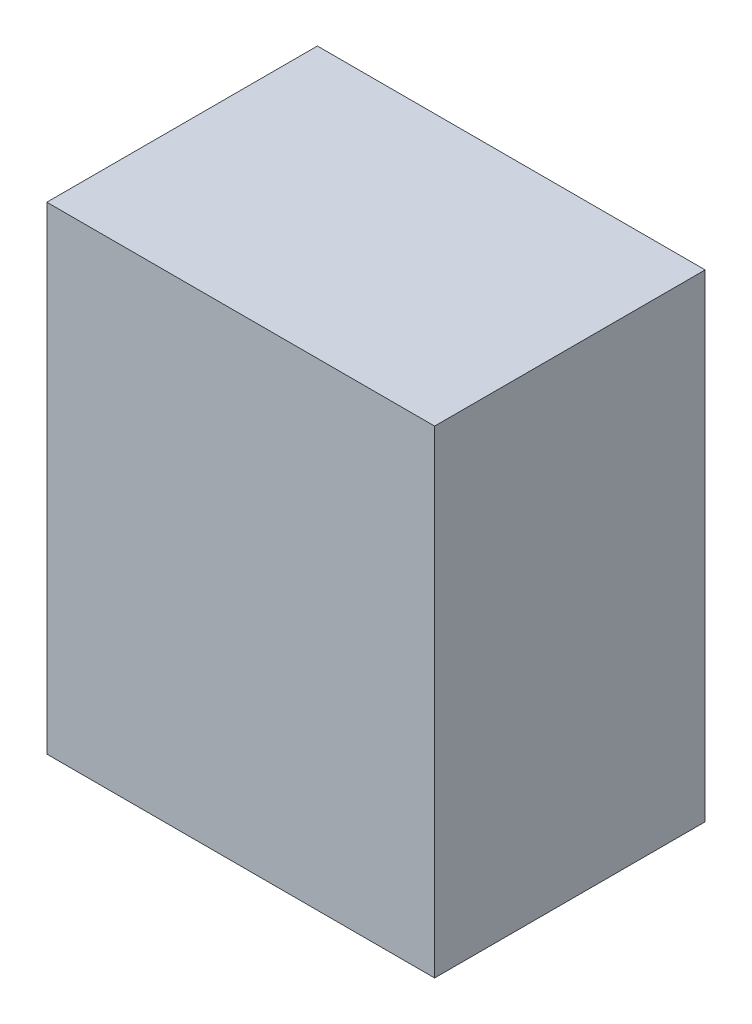
ISO-10303-21;
HEADER;
FILE_DESCRIPTION(('STEP AP214'),'2;1');
FILE_NAME('part.step','',(''),(''),'','','');
FILE_SCHEMA(('AUTOMOTIVE_DESIGN { 1 0 10303 214 1 1 1 1 }'));
ENDSEC;
DATA;
#1=APPLICATION_CONTEXT('core data for automotive mechanical design processes');
#2=APPLICATION_PROTOCOL_DEFINITION('international standard','automotive_design',2000,#1);
#3=PRODUCT_CONTEXT('',#1,'mechanical');
#4=PRODUCT('Part','Part','',(#3));
#5=PRODUCT_RELATED_PRODUCT_CATEGORY('part','',(#4));
#6=PRODUCT_DEFINITION_FORMATION('','',#4);
#7=PRODUCT_DEFINITION_CONTEXT('part definition',#1,'design');
#8=PRODUCT_DEFINITION('design','',#6,#7);
#9=PRODUCT_DEFINITION_SHAPE('','',#8);
#10=(LENGTH_UNIT() NAMED_UNIT(*) SI_UNIT(.MILLI.,.METRE.));
#11=(NAMED_UNIT(*) PLANE_ANGLE_UNIT() SI_UNIT($,.RADIAN.));
#12=(NAMED_UNIT(*) SI_UNIT($,.STERADIAN.) SOLID_ANGLE_UNIT());
#13=UNCERTAINTY_MEASURE_WITH_UNIT(LENGTH_MEASURE(1.E-05),#10,'distance_accuracy_value','');
#14=(GEOMETRIC_REPRESENTATION_CONTEXT(3) GLOBAL_UNCERTAINTY_ASSIGNED_CONTEXT((#13)) GLOBAL_UNIT_ASSIGNED_CONTEXT((#10,
#11,#12)) REPRESENTATION_CONTEXT('',''));
#15=CARTESIAN_POINT('',(0.,0.,0.));
#16=DIRECTION('',(0.,0.,1.));
#17=DIRECTION('',(1.,0.,0.));
#18=AXIS2_PLACEMENT_3D('',#15,#16,#17);
#19=CARTESIAN_POINT('',(-1.50499826,-1.85499756,2.10000088));
#20=DIRECTION('',(0.,0.,1.));
#21=DIRECTION('',(1.,0.,0.));
#22=AXIS2_PLACEMENT_3D('',#19,#20,#21);
#23=PLANE('',#22);
#24=DIRECTION('',(-1.,0.,0.));
#25=VECTOR('',#24,1.);
#26=CARTESIAN_POINT('',(1.50499826,-1.85499756,2.10000088));
#27=LINE('',#26,#25);
#28=CARTESIAN_POINT('',(1.50499826,-1.85499756,2.10000088));
#29=VERTEX_POINT('',#28);
#30=CARTESIAN_POINT('',(-1.50499826,-1.85499756,2.10000088));
#31=VERTEX_POINT('',#30);
#32=EDGE_CURVE('E25',#29,#31,#27,.T.);
#33=ORIENTED_EDGE('',*,*,#32,.F.);
#34=DIRECTION('',(0.,-1.,0.));
#35=VECTOR('',#34,1.);
#36=CARTESIAN_POINT('',(1.50499826,1.85499756,2.10000088));
#37=LINE('',#36,#35);
#38=CARTESIAN_POINT('',(1.50499826,1.85499756,2.10000088));
#39=VERTEX_POINT('',#38);
#40=EDGE_CURVE('E67',#39,#29,#37,.T.);
#41=ORIENTED_EDGE('',*,*,#40,.F.);
#42=DIRECTION('',(1.,0.,0.));
#43=VECTOR('',#42,1.);
#44=CARTESIAN_POINT('',(-1.50499826,1.85499756,2.10000088));
#45=LINE('',#44,#43);
#46=CARTESIAN_POINT('',(-1.50499826,1.85499756,2.10000088));
#47=VERTEX_POINT('',#46);
#48=EDGE_CURVE('E70',#47,#39,#45,.T.);
#49=ORIENTED_EDGE('',*,*,#48,.F.);
#50=DIRECTION('',(0.,1.,0.));
#51=VECTOR('',#50,1.);
#52=CARTESIAN_POINT('',(-1.50499826,-1.85499756,2.10000088));
#53=LINE('',#52,#51);
#54=EDGE_CURVE('E115',#31,#47,#53,.T.);
#55=ORIENTED_EDGE('',*,*,#54,.F.);
#56=EDGE_LOOP('',(#33,#41,#49,#55));
#57=FACE_BOUND('',#56,.T.);
#58=ADVANCED_FACE('F17',(#57),#23,.T.);
#59=CARTESIAN_POINT('',(-1.50499826,-1.85499756,0.));
#60=DIRECTION('',(0.,0.,1.));
#61=DIRECTION('',(1.,0.,0.));
#62=AXIS2_PLACEMENT_3D('',#59,#60,#61);
#63=PLANE('',#62);
#64=DIRECTION('',(0.,1.,0.));
#65=VECTOR('',#64,1.);
#66=CARTESIAN_POINT('',(-1.50499826,-1.85499756,0.));
#67=LINE('',#66,#65);
#68=CARTESIAN_POINT('',(-1.50499826,-1.85499756,0.));
#69=VERTEX_POINT('',#68);
#70=CARTESIAN_POINT('',(-1.50499826,1.85499756,0.));
#71=VERTEX_POINT('',#70);
#72=EDGE_CURVE('E91',#69,#71,#67,.T.);
#73=ORIENTED_EDGE('',*,*,#72,.T.);
#74=DIRECTION('',(1.,0.,0.));
#75=VECTOR('',#74,1.);
#76=CARTESIAN_POINT('',(-1.50499826,1.85499756,0.));
#77=LINE('',#76,#75);
#78=CARTESIAN_POINT('',(1.50499826,1.85499756,0.));
#79=VERTEX_POINT('',#78);
#80=EDGE_CURVE('E76',#71,#79,#77,.T.);
#81=ORIENTED_EDGE('',*,*,#80,.T.);
#82=DIRECTION('',(0.,-1.,0.));
#83=VECTOR('',#82,1.);
#84=CARTESIAN_POINT('',(1.50499826,1.85499756,0.));
#85=LINE('',#84,#83);
#86=CARTESIAN_POINT('',(1.50499826,-1.85499756,0.));
#87=VERTEX_POINT('',#86);
#88=EDGE_CURVE('E81',#79,#87,#85,.T.);
#89=ORIENTED_EDGE('',*,*,#88,.T.);
#90=DIRECTION('',(-1.,0.,0.));
#91=VECTOR('',#90,1.);
#92=CARTESIAN_POINT('',(1.50499826,-1.85499756,0.));
#93=LINE('',#92,#91);
#94=EDGE_CURVE('E11',#87,#69,#93,.T.);
#95=ORIENTED_EDGE('',*,*,#94,.T.);
#96=EDGE_LOOP('',(#73,#81,#89,#95));
#97=FACE_BOUND('',#96,.T.);
#98=ADVANCED_FACE('F129',(#97),#63,.F.);
#99=CARTESIAN_POINT('',(1.50499826,-1.85499756,0.));
#100=DIRECTION('',(0.,-1.,0.));
#101=DIRECTION('',(0.,0.,-1.));
#102=AXIS2_PLACEMENT_3D('',#99,#100,#101);
#103=PLANE('',#102);
#104=DIRECTION('',(0.,0.,1.));
#105=VECTOR('',#104,1.);
#106=CARTESIAN_POINT('',(1.50499826,-1.85499756,0.));
#107=LINE('',#106,#105);
#108=EDGE_CURVE('E75',#87,#29,#107,.T.);
#109=ORIENTED_EDGE('',*,*,#108,.T.);
#110=ORIENTED_EDGE('',*,*,#32,.T.);
#111=DIRECTION('',(0.,0.,1.));
#112=VECTOR('',#111,1.);
#113=CARTESIAN_POINT('',(-1.50499826,-1.85499756,0.));
#114=LINE('',#113,#112);
#115=EDGE_CURVE('E114',#69,#31,#114,.T.);
#116=ORIENTED_EDGE('',*,*,#115,.F.);
#117=ORIENTED_EDGE('',*,*,#94,.F.);
#118=EDGE_LOOP('',(#109,#110,#116,#117));
#119=FACE_BOUND('',#118,.T.);
#120=ADVANCED_FACE('F127',(#119),#103,.T.);
#121=CARTESIAN_POINT('',(1.50499826,1.85499756,0.));
#122=DIRECTION('',(1.,0.,0.));
#123=DIRECTION('',(0.,1.,0.));
#124=AXIS2_PLACEMENT_3D('',#121,#122,#123);
#125=PLANE('',#124);
#126=DIRECTION('',(0.,0.,1.));
#127=VECTOR('',#126,1.);
#128=CARTESIAN_POINT('',(1.50499826,1.85499756,0.));
#129=LINE('',#128,#127);
#130=EDGE_CURVE('E79',#79,#39,#129,.T.);
#131=ORIENTED_EDGE('',*,*,#130,.T.);
#132=ORIENTED_EDGE('',*,*,#40,.T.);
#133=ORIENTED_EDGE('',*,*,#108,.F.);
#134=ORIENTED_EDGE('',*,*,#88,.F.);
#135=EDGE_LOOP('',(#131,#132,#133,#134));
#136=FACE_BOUND('',#135,.T.);
#137=ADVANCED_FACE('F80',(#136),#125,.T.);
#138=CARTESIAN_POINT('',(-1.50499826,1.85499756,0.));
#139=DIRECTION('',(0.,1.,0.));
#140=DIRECTION('',(1.,0.,0.));
#141=AXIS2_PLACEMENT_3D('',#138,#139,#140);
#142=PLANE('',#141);
#143=DIRECTION('',(0.,0.,1.));
#144=VECTOR('',#143,1.);
#145=CARTESIAN_POINT('',(-1.50499826,1.85499756,0.));
#146=LINE('',#145,#144);
#147=EDGE_CURVE('E88',#71,#47,#146,.T.);
#148=ORIENTED_EDGE('',*,*,#147,.T.);
#149=ORIENTED_EDGE('',*,*,#48,.T.);
#150=ORIENTED_EDGE('',*,*,#130,.F.);
#151=ORIENTED_EDGE('',*,*,#80,.F.);
#152=EDGE_LOOP('',(#148,#149,#150,#151));
#153=FACE_BOUND('',#152,.T.);
#154=ADVANCED_FACE('F86',(#153),#142,.T.);
#155=CARTESIAN_POINT('',(-1.50499826,-1.85499756,0.));
#156=DIRECTION('',(-1.,0.,0.));
#157=DIRECTION('',(0.,0.,1.));
#158=AXIS2_PLACEMENT_3D('',#155,#156,#157);
#159=PLANE('',#158);
#160=ORIENTED_EDGE('',*,*,#115,.T.);
#161=ORIENTED_EDGE('',*,*,#54,.T.);
#162=ORIENTED_EDGE('',*,*,#147,.F.);
#163=ORIENTED_EDGE('',*,*,#72,.F.);
#164=EDGE_LOOP('',(#160,#161,#162,#163));
#165=FACE_BOUND('',#164,.T.);
#166=ADVANCED_FACE('F126',(#165),#159,.T.);
#167=CLOSED_SHELL('',(#58,#98,#120,#137,#154,#166));
#168=MANIFOLD_SOLID_BREP('B1',#167);
#169=ADVANCED_BREP_SHAPE_REPRESENTATION('',(#18,#168),#14);
#170=SHAPE_DEFINITION_REPRESENTATION(#9,#169);
ENDSEC;
END-ISO-10303-21;
